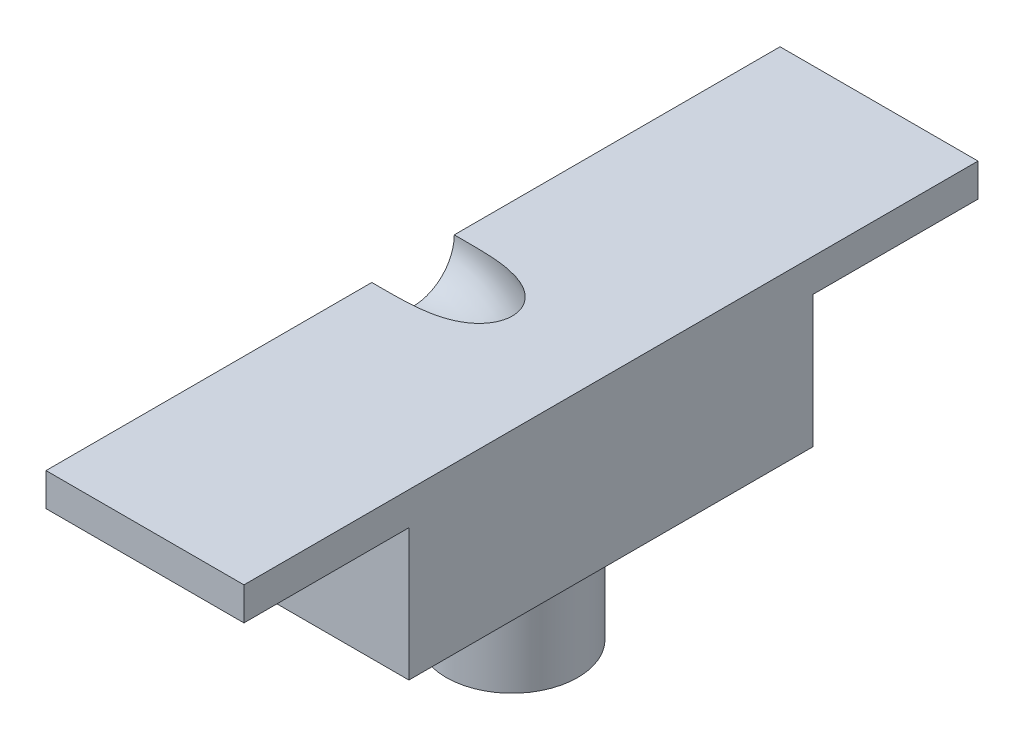
ISO-10303-21;
HEADER;
FILE_DESCRIPTION(('STEP AP214'),'2;1');
FILE_NAME('part.step','',(''),(''),'','','');
FILE_SCHEMA(('AUTOMOTIVE_DESIGN { 1 0 10303 214 1 1 1 1 }'));
ENDSEC;
DATA;
#1=APPLICATION_CONTEXT('core data for automotive mechanical design processes');
#2=APPLICATION_PROTOCOL_DEFINITION('international standard','automotive_design',2000,#1);
#3=PRODUCT_CONTEXT('',#1,'mechanical');
#4=PRODUCT('Part','Part','',(#3));
#5=PRODUCT_RELATED_PRODUCT_CATEGORY('part','',(#4));
#6=PRODUCT_DEFINITION_FORMATION('','',#4);
#7=PRODUCT_DEFINITION_CONTEXT('part definition',#1,'design');
#8=PRODUCT_DEFINITION('design','',#6,#7);
#9=PRODUCT_DEFINITION_SHAPE('','',#8);
#10=(LENGTH_UNIT() NAMED_UNIT(*) SI_UNIT(.MILLI.,.METRE.));
#11=(NAMED_UNIT(*) PLANE_ANGLE_UNIT() SI_UNIT($,.RADIAN.));
#12=(NAMED_UNIT(*) SI_UNIT($,.STERADIAN.) SOLID_ANGLE_UNIT());
#13=UNCERTAINTY_MEASURE_WITH_UNIT(LENGTH_MEASURE(1.E-05),#10,'distance_accuracy_value','');
#14=(GEOMETRIC_REPRESENTATION_CONTEXT(3) GLOBAL_UNCERTAINTY_ASSIGNED_CONTEXT((#13)) GLOBAL_UNIT_ASSIGNED_CONTEXT((#10,
#11,#12)) REPRESENTATION_CONTEXT('',''));
#15=CARTESIAN_POINT('',(0.,0.,0.));
#16=DIRECTION('',(0.,0.,1.));
#17=DIRECTION('',(1.,0.,0.));
#18=AXIS2_PLACEMENT_3D('',#15,#16,#17);
#19=CARTESIAN_POINT('',(-6.,17.,12.25));
#20=DIRECTION('',(0.,0.,-1.));
#21=DIRECTION('',(-1.,0.,0.));
#22=AXIS2_PLACEMENT_3D('',#19,#20,#21);
#23=PLANE('',#22);
#24=DIRECTION('',(1.,0.,0.));
#25=VECTOR('',#24,1.);
#26=CARTESIAN_POINT('',(-16.1980390271856,15.,12.25));
#27=LINE('',#26,#25);
#28=CARTESIAN_POINT('',(-6.,15.,12.25));
#29=VERTEX_POINT('',#28);
#30=CARTESIAN_POINT('',(6.,15.,12.25));
#31=VERTEX_POINT('',#30);
#32=EDGE_CURVE('E66',#29,#31,#27,.T.);
#33=ORIENTED_EDGE('',*,*,#32,.F.);
#34=DIRECTION('',(0.,-1.,0.));
#35=VECTOR('',#34,1.);
#36=CARTESIAN_POINT('',(-6.,17.,12.25));
#37=LINE('',#36,#35);
#38=CARTESIAN_POINT('',(-6.,7.,12.25));
#39=VERTEX_POINT('',#38);
#40=EDGE_CURVE('E256',#29,#39,#37,.T.);
#41=ORIENTED_EDGE('',*,*,#40,.T.);
#42=DIRECTION('',(1.,0.,0.));
#43=VECTOR('',#42,1.);
#44=CARTESIAN_POINT('',(-6.,7.,12.25));
#45=LINE('',#44,#43);
#46=CARTESIAN_POINT('',(6.,7.,12.25));
#47=VERTEX_POINT('',#46);
#48=EDGE_CURVE('E243',#39,#47,#45,.T.);
#49=ORIENTED_EDGE('',*,*,#48,.T.);
#50=DIRECTION('',(0.,-1.,0.));
#51=VECTOR('',#50,1.);
#52=CARTESIAN_POINT('',(6.,17.,12.25));
#53=LINE('',#52,#51);
#54=EDGE_CURVE('E254',#31,#47,#53,.T.);
#55=ORIENTED_EDGE('',*,*,#54,.F.);
#56=EDGE_LOOP('',(#33,#41,#49,#55));
#57=FACE_BOUND('',#56,.T.);
#58=ADVANCED_FACE('F37',(#57),#23,.F.);
#59=CARTESIAN_POINT('',(-6.,17.,-12.25));
#60=DIRECTION('',(1.,0.,0.));
#61=DIRECTION('',(0.,0.,-1.));
#62=AXIS2_PLACEMENT_3D('',#59,#60,#61);
#63=PLANE('',#62);
#64=CARTESIAN_POINT('',(-5.99999999662112,16.9911062608069,-2.5));
#65=CARTESIAN_POINT('',(-5.99999999548499,17.0612754814872,-2.49999917679118));
#66=CARTESIAN_POINT('',(-5.99999999878975,17.1314648255298,-2.49704278144887));
#67=CARTESIAN_POINT('',(-6.00000000121075,17.2713632531672,-2.48523473279341));
#68=CARTESIAN_POINT('',(-6.00000000032525,17.3410721256429,-2.47638063649341));
#69=CARTESIAN_POINT('',(-5.9999999996741,17.4796447102253,-2.45281166015836));
#70=CARTESIAN_POINT('',(-5.99999999991072,17.5485064272413,-2.43808495975812));
#71=CARTESIAN_POINT('',(-6.00000000008935,17.6847798912383,-2.40287278981151));
#72=CARTESIAN_POINT('',(-6.00000000003112,17.752190462718,-2.38238282770307));
#73=CARTESIAN_POINT('',(-5.99999999993793,17.9512084057132,-2.31256133726961));
#74=CARTESIAN_POINT('',(-5.99999999998374,18.0799684802196,-2.25481546024213));
#75=CARTESIAN_POINT('',(-6.00000000001626,18.3259528146609,-2.11849508044642));
#76=CARTESIAN_POINT('',(-6.00000000000298,18.443176550403,-2.03991963181432));
#77=CARTESIAN_POINT('',(-5.99999999999851,18.6078105782702,-1.90822461927894));
#78=CARTESIAN_POINT('',(-5.9999999999996,18.6608519972462,-1.86198696101606));
#79=CARTESIAN_POINT('',(-6.0000000000004,18.7628145374143,-1.76524422547874));
#80=CARTESIAN_POINT('',(-6.00000000000011,18.8117395860872,-1.71474331017464));
#81=CARTESIAN_POINT('',(-5.99999999999989,18.9051843007496,-1.60977361664169));
#82=CARTESIAN_POINT('',(-5.99999999999997,18.9497018214781,-1.55530292839372));
#83=CARTESIAN_POINT('',(-6.00000000000003,19.0339941940812,-1.44280976211572));
#84=CARTESIAN_POINT('',(-6.00000000000001,19.0737679441262,-1.38478646364321));
#85=CARTESIAN_POINT('',(-5.99999999999998,19.1855009029571,-1.20602374612361));
#86=CARTESIAN_POINT('',(-5.99999999999999,19.2499730658632,-1.08047756158767));
#87=CARTESIAN_POINT('',(-6.00000000000001,19.3568849024175,-0.820411560107901));
#88=CARTESIAN_POINT('',(-6.,19.39932495243,-0.685891896498042));
#89=CARTESIAN_POINT('',(-6.,19.4610294512489,-0.411620891112567));
#90=CARTESIAN_POINT('',(-6.,19.4802940265194,-0.271869577889315));
#91=CARTESIAN_POINT('',(-6.,19.4950815594367,0.00888374290003644));
#92=CARTESIAN_POINT('',(-6.,19.4906044836919,0.149885752224917));
#93=CARTESIAN_POINT('',(-6.,19.4580537816676,0.429119507088818));
#94=CARTESIAN_POINT('',(-6.,19.4299803887296,0.567351280008554));
#95=CARTESIAN_POINT('',(-6.,19.35098213126,0.837204274468014));
#96=CARTESIAN_POINT('',(-6.,19.3000571339859,0.968825457602624));
#97=CARTESIAN_POINT('',(-6.,19.2077259873993,1.1583299987547));
#98=CARTESIAN_POINT('',(-6.,19.1742702584347,1.2202068802919));
#99=CARTESIAN_POINT('',(-6.,19.1022674539404,1.34092578269892));
#100=CARTESIAN_POINT('',(-6.,19.0637215567942,1.39976850161244));
#101=CARTESIAN_POINT('',(-6.,18.9818253144,1.51397139678755));
#102=CARTESIAN_POINT('',(-6.,18.9384770129003,1.56933303887901));
#103=CARTESIAN_POINT('',(-6.,18.8472433759708,1.67625270987987));
#104=CARTESIAN_POINT('',(-6.,18.7993537108727,1.72780702395053));
#105=CARTESIAN_POINT('',(-6.,18.6494717250249,1.87606618088082));
#106=CARTESIAN_POINT('',(-6.,18.5411570244777,1.96651946601354));
#107=CARTESIAN_POINT('',(-6.,18.310864941686,2.12792603606321));
#108=CARTESIAN_POINT('',(-6.,18.1888879249075,2.19887984241456));
#109=CARTESIAN_POINT('',(-6.,17.9983413386896,2.28921057991852));
#110=CARTESIAN_POINT('',(-6.,17.9334885954531,2.3166582827175));
#111=CARTESIAN_POINT('',(-6.,17.801740105853,2.36597406775493));
#112=CARTESIAN_POINT('',(-6.,17.7348461514001,2.38784689468328));
#113=CARTESIAN_POINT('',(-6.,17.5995323641709,2.42585377885879));
#114=CARTESIAN_POINT('',(-6.,17.5311143095163,2.44199418590801));
#115=CARTESIAN_POINT('',(-6.,17.3931712246026,2.46845705381251));
#116=CARTESIAN_POINT('',(-6.,17.3236463596585,2.4787803752869));
#117=CARTESIAN_POINT('',(-6.,17.1849138514212,2.49343939105746));
#118=CARTESIAN_POINT('',(-6.,17.115714495176,2.49785366480318));
#119=CARTESIAN_POINT('',(-6.,16.9771882164399,2.50092099991182));
#120=CARTESIAN_POINT('',(-6.,16.9078612939518,2.49957406140349));
#121=CARTESIAN_POINT('',(-6.,16.7686148621845,2.4910701624752));
#122=CARTESIAN_POINT('',(-6.,16.6987001589193,2.48383424552796));
#123=CARTESIAN_POINT('',(-6.,16.5597188895675,2.46350277056509));
#124=CARTESIAN_POINT('',(-6.,16.4906524505504,2.45040634538719));
#125=CARTESIAN_POINT('',(-6.,16.3537869693681,2.41842553953638));
#126=CARTESIAN_POINT('',(-6.,16.2859894227403,2.39953473565595));
#127=CARTESIAN_POINT('',(-6.,16.1521852341975,2.35609808906815));
#128=CARTESIAN_POINT('',(-6.,16.0861801725279,2.3315474267038));
#129=CARTESIAN_POINT('',(-6.,15.891815875474,2.24973654924145));
#130=CARTESIAN_POINT('',(-6.,15.7668128733292,2.18424826689066));
#131=CARTESIAN_POINT('',(-6.,15.5295932760164,2.03318590316982));
#132=CARTESIAN_POINT('',(-6.,15.4173770235171,1.94761128369938));
#133=CARTESIAN_POINT('',(-6.,15.261074321427,1.80612426724228));
#134=CARTESIAN_POINT('',(-6.,15.2109479532827,1.75673750827536));
#135=CARTESIAN_POINT('',(-6.,15.1150681443904,1.65395522776921));
#136=CARTESIAN_POINT('',(-6.,15.0693105420613,1.60056360952937));
#137=CARTESIAN_POINT('',(-6.,14.9824373937259,1.49009147512444));
#138=CARTESIAN_POINT('',(-6.,14.941323824644,1.43300940410208));
#139=CARTESIAN_POINT('',(-6.,14.8640468820907,1.31558933786349));
#140=CARTESIAN_POINT('',(-6.,14.8278846550366,1.25525059310146));
#141=CARTESIAN_POINT('',(-6.,14.7272567052061,1.07001069770285));
#142=CARTESIAN_POINT('',(-6.,14.6705572121912,0.940768034008188));
#143=CARTESIAN_POINT('',(-6.,14.5796964605777,0.674667218976949));
#144=CARTESIAN_POINT('',(-6.,14.5455350669525,0.537809113270133));
#145=CARTESIAN_POINT('',(-6.,14.500665019495,0.260286212007485));
#146=CARTESIAN_POINT('',(-6.,14.4899557991788,0.119621508482579));
#147=CARTESIAN_POINT('',(-6.,14.4923111099998,-0.161508508379609));
#148=CARTESIAN_POINT('',(-6.,14.505375604113,-0.30197382202707));
#149=CARTESIAN_POINT('',(-6.,14.5548879033267,-0.578699241367726));
#150=CARTESIAN_POINT('',(-6.,14.5913352077604,-0.714959437034378));
#151=CARTESIAN_POINT('',(-6.,14.6866354677337,-0.97949031304884));
#152=CARTESIAN_POINT('',(-6.00000000000001,14.7454888056624,-1.10776085699903));
#153=CARTESIAN_POINT('',(-6.,14.8492003762446,-1.2912846082618));
#154=CARTESIAN_POINT('',(-5.99999999999999,14.8863667900878,-1.35100834794157));
#155=CARTESIAN_POINT('',(-6.00000000000001,14.9655966551264,-1.46711606795183));
#156=CARTESIAN_POINT('',(-6.00000000000004,15.0076589694084,-1.52350081908329));
#157=CARTESIAN_POINT('',(-5.99999999999996,15.096364294603,-1.63249795792673));
#158=CARTESIAN_POINT('',(-5.99999999999984,15.1430050783876,-1.6851121584291));
#159=CARTESIAN_POINT('',(-6.00000000000016,15.2405831469697,-1.78626796361863));
#160=CARTESIAN_POINT('',(-6.0000000000006,15.2915245389584,-1.8348055847889));
#161=CARTESIAN_POINT('',(-5.9999999999988,15.4501650312028,-1.97365345303115));
#162=CARTESIAN_POINT('',(-5.99999999999346,15.5637940417232,-2.05733800743019));
#163=CARTESIAN_POINT('',(-6.00000000000654,15.8034988775456,-2.20440874381926));
#164=CARTESIAN_POINT('',(-6.00000000002498,15.9295741380282,-2.26779584636803));
#165=CARTESIAN_POINT('',(-5.99999999998748,16.1253037659603,-2.34635728850237));
#166=CARTESIAN_POINT('',(-5.99999999996405,16.1917413817409,-2.36981113041721));
#167=CARTESIAN_POINT('',(-6.00000000003593,16.326322814736,-2.41102103232568));
#168=CARTESIAN_POINT('',(-6.00000000013114,16.3944652588285,-2.42878152815142));
#169=CARTESIAN_POINT('',(-5.99999999986912,16.5318589404491,-2.45846146959885));
#170=CARTESIAN_POINT('',(-5.9999999995128,16.6011076616145,-2.47039263563448));
#171=CARTESIAN_POINT('',(-6.000000000487,16.7403464906537,-2.48838188700288));
#172=CARTESIAN_POINT('',(-6.00000000181682,16.810336279464,-2.49444240365856));
#173=CARTESIAN_POINT('',(-5.99999999904449,16.9173043446433,-2.4991833634724));
#174=CARTESIAN_POINT('',(-5.99999999721864,16.9542025196941,-2.50000043294602));
#175=CARTESIAN_POINT('',(-5.99999999662112,16.9911062608069,-2.5));
#176=B_SPLINE_CURVE_WITH_KNOTS('',3,(#64,#65,#66,#67,#68,#69,#70,#71,#72,#73,#74,#75,#76,#77,
#78,#79,#80,#81,#82,#83,#84,#85,#86,#87,#88,#89,#90,#91,#92,#93,#94,#95,#96,#97,#98,#99,#100,
#101,#102,#103,#104,#105,#106,#107,#108,#109,#110,#111,#112,#113,#114,#115,#116,#117,#118,#119,
#120,#121,#122,#123,#124,#125,#126,#127,#128,#129,#130,#131,#132,#133,#134,#135,#136,#137,#138,
#139,#140,#141,#142,#143,#144,#145,#146,#147,#148,#149,#150,#151,#152,#153,#154,#155,#156,#157,
#158,#159,#160,#161,#162,#163,#164,#165,#166,#167,#168,#169,#170,#171,#172,#173,#174,#175),
.UNSPECIFIED.,.T.,.F.,(4,2,2,2,2,2,2,2,2,2,2,2,2,2,2,2,2,2,2,2,2,2,2,2,2,2,2,2,2,2,2,2,2,2,2,2,
2,2,2,2,2,2,2,2,2,2,2,2,2,2,2,2,2,2,2,4),(0.,0.210479846317896,0.421046933330952,
0.632040006068487,0.84319800955464,1.26441282210354,1.68564676515317,1.89653372219488,
2.10721713201651,2.31800258806673,2.52883690803406,2.95005403726525,3.37126397080816,
3.79247160588165,4.21367983336912,4.63488389562474,5.05609040463916,5.2669115412899,
5.47768395773118,5.68836701831692,5.8992530000182,6.32046976903219,6.74167527321727,
6.95273164131906,7.16360777826945,7.37424959376991,7.58486023730335,7.79264136262042,
8.00042248329414,8.21103624219388,8.421681175306,8.63256046246107,8.84361999171499,
9.26484263021229,9.68607655428826,9.89697183796575,10.1076641805053,10.3184458775939,
10.529276296144,10.9504933463207,11.3717078729455,11.7929122250803,12.2141159212508,
12.6353105990146,13.0565124653538,13.267338560284,13.4781157950325,13.6887910036798,
13.8996697393198,14.3208948454103,14.7421008447977,14.9532591853179,15.1642526048195,
15.3748200384167,15.5853002284139,15.6959968227706),.UNSPECIFIED.);
#177=CARTESIAN_POINT('',(-6.,17.,2.49998418083522));
#178=VERTEX_POINT('',#177);
#179=CARTESIAN_POINT('',(-6.00000000000001,17.,-2.49998418083522));
#180=VERTEX_POINT('',#179);
#181=EDGE_CURVE('E161',#178,#180,#176,.T.);
#182=ORIENTED_EDGE('',*,*,#181,.T.);
#183=DIRECTION('',(0.,0.,1.));
#184=VECTOR('',#183,1.);
#185=CARTESIAN_POINT('',(-6.,17.,-12.25));
#186=LINE('',#185,#184);
#187=CARTESIAN_POINT('',(-6.,17.,-22.25));
#188=VERTEX_POINT('',#187);
#189=EDGE_CURVE('E249',#188,#180,#186,.T.);
#190=ORIENTED_EDGE('',*,*,#189,.F.);
#191=DIRECTION('',(0.,-1.,0.));
#192=VECTOR('',#191,1.);
#193=CARTESIAN_POINT('',(-6.,17.,-22.25));
#194=LINE('',#193,#192);
#195=CARTESIAN_POINT('',(-6.,15.,-22.25));
#196=VERTEX_POINT('',#195);
#197=EDGE_CURVE('E136',#188,#196,#194,.T.);
#198=ORIENTED_EDGE('',*,*,#197,.T.);
#199=DIRECTION('',(0.,0.,1.));
#200=VECTOR('',#199,1.);
#201=CARTESIAN_POINT('',(-6.,15.,-12.25));
#202=LINE('',#201,#200);
#203=CARTESIAN_POINT('',(-6.,15.,-12.25));
#204=VERTEX_POINT('',#203);
#205=EDGE_CURVE('E117',#196,#204,#202,.T.);
#206=ORIENTED_EDGE('',*,*,#205,.T.);
#207=DIRECTION('',(0.,-1.,0.));
#208=VECTOR('',#207,1.);
#209=CARTESIAN_POINT('',(-6.,17.,-12.25));
#210=LINE('',#209,#208);
#211=CARTESIAN_POINT('',(-6.,7.,-12.25));
#212=VERTEX_POINT('',#211);
#213=EDGE_CURVE('E228',#204,#212,#210,.T.);
#214=ORIENTED_EDGE('',*,*,#213,.T.);
#215=DIRECTION('',(0.,0.,1.));
#216=VECTOR('',#215,1.);
#217=CARTESIAN_POINT('',(-6.,7.,-12.25));
#218=LINE('',#217,#216);
#219=EDGE_CURVE('E247',#212,#39,#218,.T.);
#220=ORIENTED_EDGE('',*,*,#219,.T.);
#221=ORIENTED_EDGE('',*,*,#40,.F.);
#222=DIRECTION('',(0.,0.,1.));
#223=VECTOR('',#222,1.);
#224=CARTESIAN_POINT('',(-6.,15.,12.25));
#225=LINE('',#224,#223);
#226=CARTESIAN_POINT('',(-6.,15.,22.25));
#227=VERTEX_POINT('',#226);
#228=EDGE_CURVE('E145',#29,#227,#225,.T.);
#229=ORIENTED_EDGE('',*,*,#228,.T.);
#230=DIRECTION('',(0.,1.,0.));
#231=VECTOR('',#230,1.);
#232=CARTESIAN_POINT('',(-6.,17.,22.25));
#233=LINE('',#232,#231);
#234=CARTESIAN_POINT('',(-6.,17.,22.25));
#235=VERTEX_POINT('',#234);
#236=EDGE_CURVE('E142',#227,#235,#233,.T.);
#237=ORIENTED_EDGE('',*,*,#236,.T.);
#238=EDGE_CURVE('E261',#178,#235,#186,.T.);
#239=ORIENTED_EDGE('',*,*,#238,.F.);
#240=EDGE_LOOP('',(#182,#190,#198,#206,#214,#220,#221,#229,#237,#239));
#241=FACE_BOUND('',#240,.T.);
#242=ADVANCED_FACE('F191',(#241),#63,.F.);
#243=CARTESIAN_POINT('',(0.,17.,0.));
#244=DIRECTION('',(0.,1.,0.));
#245=DIRECTION('',(0.,0.,1.));
#246=AXIS2_PLACEMENT_3D('',#243,#244,#245);
#247=PLANE('',#246);
#248=ORIENTED_EDGE('',*,*,#189,.T.);
#249=CARTESIAN_POINT('',(-6.,17.,-2.49998418083522));
#250=CARTESIAN_POINT('',(-5.91835423553556,17.,-2.49997692436198));
#251=CARTESIAN_POINT('',(-5.83670848015727,17.,-2.49997608089899));
#252=CARTESIAN_POINT('',(-5.67341677418639,17.,-2.49994694041733));
#253=CARTESIAN_POINT('',(-5.59177082359382,17.,-2.49991864333062));
#254=CARTESIAN_POINT('',(-5.42824329184735,17.,-2.49979413625982));
#255=CARTESIAN_POINT('',(-5.3463617106823,17.,-2.49969773051771));
#256=CARTESIAN_POINT('',(-5.18259895562537,17.,-2.49934636189439));
#257=CARTESIAN_POINT('',(-5.10071778173356,17.,-2.49909139899149));
#258=CARTESIAN_POINT('',(-4.85487874587565,17.,-2.49786733038095));
#259=CARTESIAN_POINT('',(-4.69092199115899,17.,-2.49643855586157));
#260=CARTESIAN_POINT('',(-4.36026129723892,17.,-2.49078729844717));
#261=CARTESIAN_POINT('',(-4.19355798085057,17.,-2.48651779234287));
#262=CARTESIAN_POINT('',(-3.86049933960332,17.,-2.47315275884974));
#263=CARTESIAN_POINT('',(-3.6941438331631,17.,-2.46406221297105));
#264=CARTESIAN_POINT('',(-3.362057328201,17.,-2.4387006873986));
#265=CARTESIAN_POINT('',(-3.19632595464101,17.,-2.42243510259839));
#266=CARTESIAN_POINT('',(-2.92888518641855,17.,-2.38811005879989));
#267=CARTESIAN_POINT('',(-2.82679006278956,17.,-2.37308353883606));
#268=CARTESIAN_POINT('',(-2.62333696849753,17.,-2.33853875044068));
#269=CARTESIAN_POINT('',(-2.52197911466677,17.,-2.31901978544442));
#270=CARTESIAN_POINT('',(-2.32047466375129,17.,-2.27476302712651));
#271=CARTESIAN_POINT('',(-2.22032707765619,17.,-2.25002984960771));
#272=CARTESIAN_POINT('',(-2.02173890623564,17.,-2.19458821818799));
#273=CARTESIAN_POINT('',(-1.92329823071782,17.,-2.16388008105556));
#274=CARTESIAN_POINT('',(-1.62829044511553,17.,-2.06043529442461));
#275=CARTESIAN_POINT('',(-1.43512517209203,17.,-1.97699491506601));
#276=CARTESIAN_POINT('',(-1.15961326903405,17.,-1.82648289463074));
#277=CARTESIAN_POINT('',(-1.07022725439938,17.,-1.77215094737631));
#278=CARTESIAN_POINT('',(-0.897637589032755,17.,-1.65447745599829));
#279=CARTESIAN_POINT('',(-0.814428496127563,17.,-1.59114398958742));
#280=CARTESIAN_POINT('',(-0.642178779675944,17.,-1.44324216591484));
#281=CARTESIAN_POINT('',(-0.554643209052686,17.,-1.35689643913744));
#282=CARTESIAN_POINT('',(-0.394154344540844,17.,-1.17136228267834));
#283=CARTESIAN_POINT('',(-0.321197637184144,17.,-1.07217686824038));
#284=CARTESIAN_POINT('',(-0.225457508987284,17.,-0.914486137458237));
#285=CARTESIAN_POINT('',(-0.195710100582197,17.,-0.860135527536049));
#286=CARTESIAN_POINT('',(-0.141451432181994,17.,-0.748893773826711));
#287=CARTESIAN_POINT('',(-0.116937405372343,17.,-0.692003991795548));
#288=CARTESIAN_POINT('',(-0.0736068938902154,17.,-0.576118824069872));
#289=CARTESIAN_POINT('',(-0.0547874664019893,17.,-0.517124543605164));
#290=CARTESIAN_POINT('',(-0.0232050114247722,17.,-0.397559307032677));
#291=CARTESIAN_POINT('',(-0.0104410001333279,17.,-0.33698860872796));
#292=CARTESIAN_POINT('',(0.0158187886107142,17.,-0.169712836260683));
#293=CARTESIAN_POINT('',(0.0229137092682861,17.,-0.061923925873127));
#294=CARTESIAN_POINT('',(0.0173853131005899,17.,0.153061011598504));
#295=CARTESIAN_POINT('',(0.00476848993418454,17.,0.260257222262687));
#296=CARTESIAN_POINT('',(-0.0377312643913309,17.,0.463277244562081));
#297=CARTESIAN_POINT('',(-0.0663423038643865,17.,0.559371586742345));
#298=CARTESIAN_POINT('',(-0.138288751713891,17.,0.745831879119272));
#299=CARTESIAN_POINT('',(-0.181625456253551,17.,0.836197324223357));
#300=CARTESIAN_POINT('',(-0.284400321674695,17.,1.01548777365125));
#301=CARTESIAN_POINT('',(-0.344733275367596,17.,1.10389659781258));
#302=CARTESIAN_POINT('',(-0.477279091136978,17.,1.27126639362263));
#303=CARTESIAN_POINT('',(-0.549499946682607,17.,1.35022094605148));
#304=CARTESIAN_POINT('',(-0.743562048456688,17.,1.53700248552707));
#305=CARTESIAN_POINT('',(-0.871622318605249,17.,1.63837915369197));
#306=CARTESIAN_POINT('',(-1.14218998771042,17.,1.81926533925316));
#307=CARTESIAN_POINT('',(-1.28471623356998,17.,1.89874581564606));
#308=CARTESIAN_POINT('',(-1.54719565921985,17.,2.02320098785902));
#309=CARTESIAN_POINT('',(-1.66542078687614,17.,2.07192037918565));
#310=CARTESIAN_POINT('',(-1.90573366438669,17.,2.15881813402035));
#311=CARTESIAN_POINT('',(-2.02782399885548,17.,2.19698927070997));
#312=CARTESIAN_POINT('',(-2.27542294258797,17.,2.26450740769877));
#313=CARTESIAN_POINT('',(-2.40095108224658,17.,2.29378138497641));
#314=CARTESIAN_POINT('',(-2.65348431897644,17.,2.34457721747707));
#315=CARTESIAN_POINT('',(-2.78048885343451,17.,2.36610193182712));
#316=CARTESIAN_POINT('',(-3.08139865695579,17.,2.40945921869515));
#317=CARTESIAN_POINT('',(-3.25568477187266,17.,2.42859815889744));
#318=CARTESIAN_POINT('',(-3.60508118054646,17.,2.45838259633227));
#319=CARTESIAN_POINT('',(-3.78019208728388,17.,2.46902022519656));
#320=CARTESIAN_POINT('',(-4.13086679346596,17.,2.48460822618254));
#321=CARTESIAN_POINT('',(-4.30643088571615,17.,2.48955129527769));
#322=CARTESIAN_POINT('',(-4.65102806772219,17.,2.49598999479933));
#323=CARTESIAN_POINT('',(-4.8200593976024,17.,2.49760785343211));
#324=CARTESIAN_POINT('',(-5.07348318968761,17.,2.49898912599213));
#325=CARTESIAN_POINT('',(-5.15787419726174,17.,2.49927547322104));
#326=CARTESIAN_POINT('',(-5.3266567178698,17.,2.49966893640313));
#327=CARTESIAN_POINT('',(-5.41104823090375,17.,2.49977605234528));
#328=CARTESIAN_POINT('',(-5.57953324950164,17.,2.49991365642044));
#329=CARTESIAN_POINT('',(-5.66362675507655,17.,2.49994441380683));
#330=CARTESIAN_POINT('',(-5.83181350379894,17.,2.49997563217983));
#331=CARTESIAN_POINT('',(-5.91590674694639,17.,2.49997609326399));
#332=CARTESIAN_POINT('',(-6.00000000000001,17.,2.49998418083522));
#333=B_SPLINE_CURVE_WITH_KNOTS('',3,(#249,#250,#251,#252,#253,#254,#255,#256,#257,#258,#259,
#260,#261,#262,#263,#264,#265,#266,#267,#268,#269,#270,#271,#272,#273,#274,#275,#276,#277,#278,
#279,#280,#281,#282,#283,#284,#285,#286,#287,#288,#289,#290,#291,#292,#293,#294,#295,#296,#297,
#298,#299,#300,#301,#302,#303,#304,#305,#306,#307,#308,#309,#310,#311,#312,#313,#314,#315,#316,
#317,#318,#319,#320,#321,#322,#323,#324,#325,#326,#327,#328,#329,#330,#331,#332),.UNSPECIFIED.,
.F.,.F.,(4,2,2,2,2,2,2,2,2,2,2,2,2,2,2,2,2,2,2,2,2,2,2,2,2,2,2,2,2,2,2,2,2,2,2,2,2,2,2,2,2,4),
(0.,0.244937272691824,0.48987515249649,0.735519912472074,0.981164706045561,1.4730441525851,
1.97327535124637,2.47299067249848,2.97233089782264,3.28183309033684,3.59138330429982,
3.90066063568821,4.20992157489287,4.83782866194903,5.15118406155425,5.46426001963568,
5.83181797329795,6.19928976652407,6.38493685193639,6.57048554396809,6.75593818502229,
6.94136068590259,7.26351290070016,7.58555901095714,7.88503749999956,8.18454235617673,
8.50442183835688,8.8245172939589,9.31174964953621,9.79962514578413,10.1826958666337,
10.5660283897994,10.9524270440585,11.3386829882571,11.8643683724775,12.3905397418741,
12.9173851547245,13.4244909108118,13.67766545709,13.9308400189289,14.1831205676129,
14.4354003039388),.UNSPECIFIED.);
#334=EDGE_CURVE('E11',#180,#178,#333,.T.);
#335=ORIENTED_EDGE('',*,*,#334,.T.);
#336=ORIENTED_EDGE('',*,*,#238,.T.);
#337=DIRECTION('',(1.,0.,0.));
#338=VECTOR('',#337,1.);
#339=CARTESIAN_POINT('',(-16.1980390271856,17.,22.25));
#340=LINE('',#339,#338);
#341=CARTESIAN_POINT('',(6.,17.,22.25));
#342=VERTEX_POINT('',#341);
#343=EDGE_CURVE('E153',#235,#342,#340,.T.);
#344=ORIENTED_EDGE('',*,*,#343,.T.);
#345=DIRECTION('',(0.,0.,-1.));
#346=VECTOR('',#345,1.);
#347=CARTESIAN_POINT('',(6.,17.,-12.25));
#348=LINE('',#347,#346);
#349=CARTESIAN_POINT('',(6.,17.,-22.25));
#350=VERTEX_POINT('',#349);
#351=EDGE_CURVE('E169',#342,#350,#348,.T.);
#352=ORIENTED_EDGE('',*,*,#351,.T.);
#353=DIRECTION('',(1.,0.,0.));
#354=VECTOR('',#353,1.);
#355=CARTESIAN_POINT('',(-16.1980390271856,17.,-22.25));
#356=LINE('',#355,#354);
#357=EDGE_CURVE('E120',#188,#350,#356,.T.);
#358=ORIENTED_EDGE('',*,*,#357,.F.);
#359=EDGE_LOOP('',(#248,#335,#336,#344,#352,#358));
#360=FACE_BOUND('',#359,.T.);
#361=ADVANCED_FACE('F196',(#360),#247,.T.);
#362=CARTESIAN_POINT('',(0.,0.,0.));
#363=DIRECTION('',(0.,1.,0.));
#364=DIRECTION('',(0.,0.,1.));
#365=AXIS2_PLACEMENT_3D('',#362,#363,#364);
#366=PLANE('',#365);
#367=CARTESIAN_POINT('',(0.,0.,0.));
#368=DIRECTION('',(0.,1.,0.));
#369=DIRECTION('',(0.,0.,1.));
#370=AXIS2_PLACEMENT_3D('',#367,#368,#369);
#371=CIRCLE('',#370,3.9875);
#372=CARTESIAN_POINT('',(0.,0.,3.9875));
#373=VERTEX_POINT('',#372);
#374=EDGE_CURVE('E223',#373,#373,#371,.T.);
#375=ORIENTED_EDGE('',*,*,#374,.F.);
#376=EDGE_LOOP('',(#375));
#377=FACE_BOUND('',#376,.T.);
#378=CARTESIAN_POINT('',(0.,0.,0.));
#379=DIRECTION('',(0.,1.,0.));
#380=DIRECTION('',(0.,0.,1.));
#381=AXIS2_PLACEMENT_3D('',#378,#379,#380);
#382=CIRCLE('',#381,2.5);
#383=CARTESIAN_POINT('',(0.,0.,2.5));
#384=VERTEX_POINT('',#383);
#385=EDGE_CURVE('E226',#384,#384,#382,.T.);
#386=ORIENTED_EDGE('',*,*,#385,.T.);
#387=EDGE_LOOP('',(#386));
#388=FACE_BOUND('',#387,.T.);
#389=ADVANCED_FACE('F211',(#377,#388),#366,.F.);
#390=CARTESIAN_POINT('',(0.,7.,0.));
#391=DIRECTION('',(0.,-1.,0.));
#392=DIRECTION('',(0.,0.,-1.));
#393=AXIS2_PLACEMENT_3D('',#390,#391,#392);
#394=CYLINDRICAL_SURFACE('',#393,3.9875);
#395=CARTESIAN_POINT('',(0.,7.,0.));
#396=DIRECTION('',(0.,1.,0.));
#397=DIRECTION('',(0.,0.,1.));
#398=AXIS2_PLACEMENT_3D('',#395,#396,#397);
#399=CIRCLE('',#398,3.9875);
#400=CARTESIAN_POINT('',(0.,7.,3.9875));
#401=VERTEX_POINT('',#400);
#402=EDGE_CURVE('E51',#401,#401,#399,.T.);
#403=ORIENTED_EDGE('',*,*,#402,.F.);
#404=EDGE_LOOP('',(#403));
#405=FACE_BOUND('',#404,.T.);
#406=ORIENTED_EDGE('',*,*,#374,.T.);
#407=EDGE_LOOP('',(#406));
#408=FACE_BOUND('',#407,.T.);
#409=ADVANCED_FACE('F39',(#405,#408),#394,.T.);
#410=CARTESIAN_POINT('',(0.,7.,0.));
#411=DIRECTION('',(0.,-1.,0.));
#412=DIRECTION('',(0.,0.,-1.));
#413=AXIS2_PLACEMENT_3D('',#410,#411,#412);
#414=CYLINDRICAL_SURFACE('',#413,2.5);
#415=ORIENTED_EDGE('',*,*,#385,.F.);
#416=EDGE_LOOP('',(#415));
#417=FACE_BOUND('',#416,.T.);
#418=CARTESIAN_POINT('',(0.,11.,0.));
#419=DIRECTION('',(0.,-1.,0.));
#420=DIRECTION('',(0.,0.,-1.));
#421=AXIS2_PLACEMENT_3D('',#418,#419,#420);
#422=CIRCLE('',#421,2.5);
#423=CARTESIAN_POINT('',(0.,11.,-2.5));
#424=VERTEX_POINT('',#423);
#425=EDGE_CURVE('E147',#424,#424,#422,.T.);
#426=ORIENTED_EDGE('',*,*,#425,.F.);
#427=EDGE_LOOP('',(#426));
#428=FACE_BOUND('',#427,.T.);
#429=ADVANCED_FACE('F208',(#417,#428),#414,.F.);
#430=CARTESIAN_POINT('',(6.,17.,-12.25));
#431=DIRECTION('',(-1.,0.,0.));
#432=DIRECTION('',(0.,0.,1.));
#433=AXIS2_PLACEMENT_3D('',#430,#431,#432);
#434=PLANE('',#433);
#435=DIRECTION('',(0.,0.,-1.));
#436=VECTOR('',#435,1.);
#437=CARTESIAN_POINT('',(6.,7.,-12.25));
#438=LINE('',#437,#436);
#439=CARTESIAN_POINT('',(6.,7.,-12.25));
#440=VERTEX_POINT('',#439);
#441=EDGE_CURVE('E168',#47,#440,#438,.T.);
#442=ORIENTED_EDGE('',*,*,#441,.T.);
#443=DIRECTION('',(0.,-1.,0.));
#444=VECTOR('',#443,1.);
#445=CARTESIAN_POINT('',(6.,17.,-12.25));
#446=LINE('',#445,#444);
#447=CARTESIAN_POINT('',(6.,15.,-12.25));
#448=VERTEX_POINT('',#447);
#449=EDGE_CURVE('E133',#448,#440,#446,.T.);
#450=ORIENTED_EDGE('',*,*,#449,.F.);
#451=DIRECTION('',(0.,0.,-1.));
#452=VECTOR('',#451,1.);
#453=CARTESIAN_POINT('',(6.,15.,-12.25));
#454=LINE('',#453,#452);
#455=CARTESIAN_POINT('',(6.,15.,-22.25));
#456=VERTEX_POINT('',#455);
#457=EDGE_CURVE('E58',#448,#456,#454,.T.);
#458=ORIENTED_EDGE('',*,*,#457,.T.);
#459=DIRECTION('',(0.,1.,0.));
#460=VECTOR('',#459,1.);
#461=CARTESIAN_POINT('',(6.,17.,-22.25));
#462=LINE('',#461,#460);
#463=EDGE_CURVE('E125',#456,#350,#462,.T.);
#464=ORIENTED_EDGE('',*,*,#463,.T.);
#465=ORIENTED_EDGE('',*,*,#351,.F.);
#466=DIRECTION('',(0.,-1.,0.));
#467=VECTOR('',#466,1.);
#468=CARTESIAN_POINT('',(6.,17.,22.25));
#469=LINE('',#468,#467);
#470=CARTESIAN_POINT('',(6.,15.,22.25));
#471=VERTEX_POINT('',#470);
#472=EDGE_CURVE('E141',#342,#471,#469,.T.);
#473=ORIENTED_EDGE('',*,*,#472,.T.);
#474=DIRECTION('',(0.,0.,-1.));
#475=VECTOR('',#474,1.);
#476=CARTESIAN_POINT('',(6.,15.,12.25));
#477=LINE('',#476,#475);
#478=EDGE_CURVE('E150',#471,#31,#477,.T.);
#479=ORIENTED_EDGE('',*,*,#478,.T.);
#480=ORIENTED_EDGE('',*,*,#54,.T.);
#481=EDGE_LOOP('',(#442,#450,#458,#464,#465,#473,#479,#480));
#482=FACE_BOUND('',#481,.T.);
#483=ADVANCED_FACE('F132',(#482),#434,.F.);
#484=CARTESIAN_POINT('',(-6.,17.,-12.25));
#485=DIRECTION('',(0.,0.,1.));
#486=DIRECTION('',(1.,0.,0.));
#487=AXIS2_PLACEMENT_3D('',#484,#485,#486);
#488=PLANE('',#487);
#489=ORIENTED_EDGE('',*,*,#213,.F.);
#490=DIRECTION('',(1.,0.,0.));
#491=VECTOR('',#490,1.);
#492=CARTESIAN_POINT('',(-16.1980390271856,15.,-12.25));
#493=LINE('',#492,#491);
#494=EDGE_CURVE('E121',#204,#448,#493,.T.);
#495=ORIENTED_EDGE('',*,*,#494,.T.);
#496=ORIENTED_EDGE('',*,*,#449,.T.);
#497=DIRECTION('',(-1.,0.,0.));
#498=VECTOR('',#497,1.);
#499=CARTESIAN_POINT('',(-6.,7.,-12.25));
#500=LINE('',#499,#498);
#501=EDGE_CURVE('E245',#440,#212,#500,.T.);
#502=ORIENTED_EDGE('',*,*,#501,.T.);
#503=EDGE_LOOP('',(#489,#495,#496,#502));
#504=FACE_BOUND('',#503,.T.);
#505=ADVANCED_FACE('F202',(#504),#488,.F.);
#506=CARTESIAN_POINT('',(0.,7.,0.));
#507=DIRECTION('',(0.,1.,0.));
#508=DIRECTION('',(0.,0.,1.));
#509=AXIS2_PLACEMENT_3D('',#506,#507,#508);
#510=PLANE('',#509);
#511=ORIENTED_EDGE('',*,*,#402,.T.);
#512=EDGE_LOOP('',(#511));
#513=FACE_BOUND('',#512,.T.);
#514=ORIENTED_EDGE('',*,*,#441,.F.);
#515=ORIENTED_EDGE('',*,*,#48,.F.);
#516=ORIENTED_EDGE('',*,*,#219,.F.);
#517=ORIENTED_EDGE('',*,*,#501,.F.);
#518=EDGE_LOOP('',(#514,#515,#516,#517));
#519=FACE_BOUND('',#518,.T.);
#520=ADVANCED_FACE('F200',(#513,#519),#510,.F.);
#521=CARTESIAN_POINT('',(0.,11.,-2.5));
#522=CARTESIAN_POINT('',(0.,11.0262936706715,-2.5));
#523=CARTESIAN_POINT('',(-0.000180454932896296,11.0526455472834,-2.5));
#524=CARTESIAN_POINT('',(-0.000903918339657075,11.105457980209,-2.5));
#525=CARTESIAN_POINT('',(-0.00144692659570226,11.1319185375474,-2.5));
#526=CARTESIAN_POINT('',(-0.00362224692401369,11.2114516320901,-2.5));
#527=CARTESIAN_POINT('',(-0.00580085377753461,11.2646755954853,-2.5));
#528=CARTESIAN_POINT('',(-0.0145415767473644,11.42486040814,-2.5));
#529=CARTESIAN_POINT('',(-0.0233085937397529,11.5323341870803,-2.5));
#530=CARTESIAN_POINT('',(-0.0585870204562884,11.856065050295,-2.5));
#531=CARTESIAN_POINT('',(-0.094075802940373,12.0736316749787,-2.5));
#532=CARTESIAN_POINT('',(-0.237713791670884,12.7256323020605,-2.5));
#533=CARTESIAN_POINT('',(-0.383034633069363,13.1593678401679,-2.5));
#534=CARTESIAN_POINT('',(-0.977780850535358,14.4102740214851,-2.5));
#535=CARTESIAN_POINT('',(-1.58600995608787,15.1687756766213,-2.5));
#536=CARTESIAN_POINT('',(-2.68582866216639,16.0231238238343,-2.5));
#537=CARTESIAN_POINT('',(-3.08165976263202,16.2600642338471,-2.5));
#538=CARTESIAN_POINT('',(-3.69466213857667,16.5423888529459,-2.5));
#539=CARTESIAN_POINT('',(-3.90220573967225,16.6243161153292,-2.5));
#540=CARTESIAN_POINT('',(-4.3196154950693,16.7635884934044,-2.5));
#541=CARTESIAN_POINT('',(-4.52948243257186,16.8209353714721,-2.5));
#542=CARTESIAN_POINT('',(-4.94743938522109,16.910819675684,-2.5));
#543=CARTESIAN_POINT('',(-5.15453924421206,16.941102383066,-2.5));
#544=CARTESIAN_POINT('',(-5.56419194998416,16.9801539978083,-2.5));
#545=CARTESIAN_POINT('',(-5.76674557393609,16.9889246498264,-2.5));
#546=CARTESIAN_POINT('',(-6.36641056830503,16.9946946641776,-2.5));
#547=CARTESIAN_POINT('',(-6.75552606532489,16.971152044052,-2.5));
#548=CARTESIAN_POINT('',(-7.13083990769105,16.9514826627312,-2.5));
#549=CARTESIAN_POINT('',(5.,11.,-2.5));
#550=CARTESIAN_POINT('',(5.,11.0377321000175,-2.5));
#551=CARTESIAN_POINT('',(4.99966256701412,11.0983500750205,-2.5));
#552=CARTESIAN_POINT('',(4.99831491558739,11.1967279114206,-2.5));
#553=CARTESIAN_POINT('',(4.99730469605258,11.245926202495,-2.5));
#554=CARTESIAN_POINT('',(4.99326702050088,11.3935499138232,-2.5));
#555=CARTESIAN_POINT('',(4.98923283834965,11.4920043010457,-2.5));
#556=CARTESIAN_POINT('',(4.97310952205931,11.7874844920818,-2.5));
#557=CARTESIAN_POINT('',(4.9570037208956,11.9846296539127,-2.5));
#558=CARTESIAN_POINT('',(4.89250795572595,12.5764720884289,-2.5));
#559=CARTESIAN_POINT('',(4.82799030975358,12.9716221314107,-2.5));
#560=CARTESIAN_POINT('',(4.56688758556713,14.1568179233714,-2.5));
#561=CARTESIAN_POINT('',(4.30445723865467,14.9447763555004,-2.5));
#562=CARTESIAN_POINT('',(3.19402697545485,17.2802984090043,-2.5));
#563=CARTESIAN_POINT('',(2.11740435017895,18.6232652592933,-2.5));
#564=CARTESIAN_POINT('',(0.0634361511915909,20.2188054176192,-2.5));
#565=CARTESIAN_POINT('',(-0.656087350679076,20.647748356097,-2.5));
#566=CARTESIAN_POINT('',(-1.77000578570961,21.1607750755735,-2.5));
#567=CARTESIAN_POINT('',(-2.14683516997444,21.3095989038549,-2.5));
#568=CARTESIAN_POINT('',(-2.90993117379978,21.5642124900608,-2.5));
#569=CARTESIAN_POINT('',(-3.28096184837137,21.6667508577441,-2.5));
#570=CARTESIAN_POINT('',(-4.0933948175824,21.8414667287086,-2.5));
#571=CARTESIAN_POINT('',(-4.51085620515464,21.9024084511032,-2.5));
#572=CARTESIAN_POINT('',(-5.25889146904987,21.973717606406,-2.5));
#573=CARTESIAN_POINT('',(-5.6048952094675,21.9875987667717,-2.5));
#574=CARTESIAN_POINT('',(-6.54578730533096,21.9966521003957,-2.5));
#575=CARTESIAN_POINT('',(-7.04506710936363,21.9628395672497,-2.5));
#576=CARTESIAN_POINT('',(-7.39251968890588,21.944630336504,-2.5));
#577=CARTESIAN_POINT('',(5.,11.,2.5));
#578=CARTESIAN_POINT('',(5.,11.0377321000175,2.5));
#579=CARTESIAN_POINT('',(4.99966256701412,11.0983500750205,2.5));
#580=CARTESIAN_POINT('',(4.99831491558739,11.1967279114206,2.5));
#581=CARTESIAN_POINT('',(4.99730469605258,11.245926202495,2.5));
#582=CARTESIAN_POINT('',(4.99326702050088,11.3935499138232,2.5));
#583=CARTESIAN_POINT('',(4.98923283834965,11.4920043010457,2.5));
#584=CARTESIAN_POINT('',(4.97310952205931,11.7874844920818,2.5));
#585=CARTESIAN_POINT('',(4.9570037208956,11.9846296539127,2.5));
#586=CARTESIAN_POINT('',(4.89250795572595,12.5764720884289,2.5));
#587=CARTESIAN_POINT('',(4.82799030975358,12.9716221314107,2.5));
#588=CARTESIAN_POINT('',(4.56688758556713,14.1568179233714,2.5));
#589=CARTESIAN_POINT('',(4.30445723865467,14.9447763555004,2.5));
#590=CARTESIAN_POINT('',(3.19402697545485,17.2802984090043,2.5));
#591=CARTESIAN_POINT('',(2.11740435017895,18.6232652592933,2.5));
#592=CARTESIAN_POINT('',(0.0634361511915909,20.2188054176192,2.5));
#593=CARTESIAN_POINT('',(-0.656087350679076,20.647748356097,2.5));
#594=CARTESIAN_POINT('',(-1.77000578570961,21.1607750755735,2.5));
#595=CARTESIAN_POINT('',(-2.14683516997444,21.3095989038549,2.5));
#596=CARTESIAN_POINT('',(-2.90993117379978,21.5642124900608,2.5));
#597=CARTESIAN_POINT('',(-3.28096184837137,21.6667508577441,2.5));
#598=CARTESIAN_POINT('',(-4.0933948175824,21.8414667287086,2.5));
#599=CARTESIAN_POINT('',(-4.51085620515464,21.9024084511032,2.5));
#600=CARTESIAN_POINT('',(-5.25889146904987,21.973717606406,2.5));
#601=CARTESIAN_POINT('',(-5.6048952094675,21.9875987667717,2.5));
#602=CARTESIAN_POINT('',(-6.54578730533096,21.9966521003957,2.5));
#603=CARTESIAN_POINT('',(-7.04506710936363,21.9628395672497,2.5));
#604=CARTESIAN_POINT('',(-7.39251968890588,21.944630336504,2.5));
#605=CARTESIAN_POINT('',(0.,11.,2.5));
#606=CARTESIAN_POINT('',(0.,11.0262936706715,2.5));
#607=CARTESIAN_POINT('',(-0.000180454932895985,11.0526455472834,2.5));
#608=CARTESIAN_POINT('',(-0.000903918339656763,11.105457980209,2.5));
#609=CARTESIAN_POINT('',(-0.00144692659570196,11.1319185375474,2.5));
#610=CARTESIAN_POINT('',(-0.00362224692401339,11.2114516320901,2.5));
#611=CARTESIAN_POINT('',(-0.00580085377753428,11.2646755954853,2.5));
#612=CARTESIAN_POINT('',(-0.0145415767473641,11.42486040814,2.5));
#613=CARTESIAN_POINT('',(-0.0233085937397525,11.5323341870803,2.5));
#614=CARTESIAN_POINT('',(-0.0585870204562881,11.856065050295,2.5));
#615=CARTESIAN_POINT('',(-0.0940758029403728,12.0736316749787,2.5));
#616=CARTESIAN_POINT('',(-0.237713791670884,12.7256323020605,2.5));
#617=CARTESIAN_POINT('',(-0.383034633069363,13.1593678401679,2.5));
#618=CARTESIAN_POINT('',(-0.977780850535357,14.4102740214851,2.5));
#619=CARTESIAN_POINT('',(-1.58600995608787,15.1687756766213,2.5));
#620=CARTESIAN_POINT('',(-2.68582866216639,16.0231238238343,2.5));
#621=CARTESIAN_POINT('',(-3.08165976263202,16.2600642338471,2.5));
#622=CARTESIAN_POINT('',(-3.69466213857667,16.5423888529459,2.5));
#623=CARTESIAN_POINT('',(-3.90220573967225,16.6243161153292,2.5));
#624=CARTESIAN_POINT('',(-4.3196154950693,16.7635884934044,2.5));
#625=CARTESIAN_POINT('',(-4.52948243257186,16.8209353714721,2.5));
#626=CARTESIAN_POINT('',(-4.94743938522109,16.910819675684,2.5));
#627=CARTESIAN_POINT('',(-5.15453924421206,16.941102383066,2.5));
#628=CARTESIAN_POINT('',(-5.56419194998416,16.9801539978083,2.5));
#629=CARTESIAN_POINT('',(-5.76674557393609,16.9889246498264,2.5));
#630=CARTESIAN_POINT('',(-6.36641056830503,16.9946946641776,2.5));
#631=CARTESIAN_POINT('',(-6.75552606532489,16.971152044052,2.5));
#632=CARTESIAN_POINT('',(-7.13083990769105,16.9514826627312,2.5));
#633=CARTESIAN_POINT('',(-5.,11.,2.5));
#634=CARTESIAN_POINT('',(-5.,11.0148552413255,2.5));
#635=CARTESIAN_POINT('',(-5.00002347687991,11.0069410195462,2.5));
#636=CARTESIAN_POINT('',(-5.00012275226671,11.0141880489974,2.5));
#637=CARTESIAN_POINT('',(-5.00019854924398,11.0179108725999,2.5));
#638=CARTESIAN_POINT('',(-5.00051151434891,11.0293533503571,2.5));
#639=CARTESIAN_POINT('',(-5.00083454590472,11.037346889925,2.5));
#640=CARTESIAN_POINT('',(-5.00219267555404,11.0622363241982,2.5));
#641=CARTESIAN_POINT('',(-5.00362090837511,11.0800387202479,2.5));
#642=CARTESIAN_POINT('',(-5.00968199663852,11.1356580121611,2.5));
#643=CARTESIAN_POINT('',(-5.01614191563432,11.1756412185467,2.5));
#644=CARTESIAN_POINT('',(-5.0423151689089,11.2944466807496,2.5));
#645=CARTESIAN_POINT('',(-5.07052650479339,11.3739593248354,2.5));
#646=CARTESIAN_POINT('',(-5.14958867652556,11.540249633966,2.5));
#647=CARTESIAN_POINT('',(-5.28942426235469,11.7142860939493,2.5));
#648=CARTESIAN_POINT('',(-5.43509347552437,11.8274422300495,2.5));
#649=CARTESIAN_POINT('',(-5.50723217458496,11.8723801115973,2.5));
#650=CARTESIAN_POINT('',(-5.61931849144373,11.9240026303184,2.5));
#651=CARTESIAN_POINT('',(-5.65757630937006,11.9390333268036,2.5));
#652=CARTESIAN_POINT('',(-5.72929981633882,11.9629644967479,2.5));
#653=CARTESIAN_POINT('',(-5.77800301677235,11.9751198852001,2.5));
#654=CARTESIAN_POINT('',(-5.80148395285978,11.9801726226593,2.5));
#655=CARTESIAN_POINT('',(-5.79822228326947,11.9797963150287,2.5));
#656=CARTESIAN_POINT('',(-5.86949243091846,11.9865903892107,2.5));
#657=CARTESIAN_POINT('',(-5.92859593840468,11.990250532881,2.5));
#658=CARTESIAN_POINT('',(-6.18703383127911,11.9927372279595,2.5));
#659=CARTESIAN_POINT('',(-6.46598502128615,11.9794645208543,2.5));
#660=CARTESIAN_POINT('',(-6.86916012647621,11.9583349889583,2.5));
#661=CARTESIAN_POINT('',(-5.,11.,-2.5));
#662=CARTESIAN_POINT('',(-5.,11.0148552413255,-2.5));
#663=CARTESIAN_POINT('',(-5.00002347687991,11.0069410195462,-2.5));
#664=CARTESIAN_POINT('',(-5.00012275226671,11.0141880489974,-2.5));
#665=CARTESIAN_POINT('',(-5.00019854924398,11.0179108725999,-2.5));
#666=CARTESIAN_POINT('',(-5.00051151434891,11.0293533503571,-2.5));
#667=CARTESIAN_POINT('',(-5.00083454590472,11.037346889925,-2.5));
#668=CARTESIAN_POINT('',(-5.00219267555404,11.0622363241982,-2.5));
#669=CARTESIAN_POINT('',(-5.00362090837511,11.0800387202479,-2.5));
#670=CARTESIAN_POINT('',(-5.00968199663852,11.1356580121611,-2.5));
#671=CARTESIAN_POINT('',(-5.01614191563432,11.1756412185467,-2.5));
#672=CARTESIAN_POINT('',(-5.0423151689089,11.2944466807496,-2.5));
#673=CARTESIAN_POINT('',(-5.07052650479339,11.3739593248354,-2.5));
#674=CARTESIAN_POINT('',(-5.14958867652556,11.540249633966,-2.5));
#675=CARTESIAN_POINT('',(-5.28942426235469,11.7142860939493,-2.5));
#676=CARTESIAN_POINT('',(-5.43509347552437,11.8274422300495,-2.5));
#677=CARTESIAN_POINT('',(-5.50723217458496,11.8723801115973,-2.5));
#678=CARTESIAN_POINT('',(-5.61931849144373,11.9240026303184,-2.5));
#679=CARTESIAN_POINT('',(-5.65757630937006,11.9390333268036,-2.5));
#680=CARTESIAN_POINT('',(-5.72929981633882,11.9629644967479,-2.5));
#681=CARTESIAN_POINT('',(-5.77800301677235,11.9751198852001,-2.5));
#682=CARTESIAN_POINT('',(-5.80148395285978,11.9801726226593,-2.5));
#683=CARTESIAN_POINT('',(-5.79822228326947,11.9797963150287,-2.5));
#684=CARTESIAN_POINT('',(-5.86949243091846,11.9865903892107,-2.5));
#685=CARTESIAN_POINT('',(-5.92859593840468,11.990250532881,-2.5));
#686=CARTESIAN_POINT('',(-6.18703383127911,11.9927372279595,-2.5));
#687=CARTESIAN_POINT('',(-6.46598502128615,11.9794645208543,-2.5));
#688=CARTESIAN_POINT('',(-6.86916012647621,11.9583349889583,-2.5));
#689=CARTESIAN_POINT('',(0.,11.,-2.5));
#690=CARTESIAN_POINT('',(0.,11.0262936706715,-2.5));
#691=CARTESIAN_POINT('',(-0.000180454932896296,11.0526455472834,-2.5));
#692=CARTESIAN_POINT('',(-0.000903918339657075,11.105457980209,-2.5));
#693=CARTESIAN_POINT('',(-0.00144692659570226,11.1319185375474,-2.5));
#694=CARTESIAN_POINT('',(-0.00362224692401369,11.2114516320901,-2.5));
#695=CARTESIAN_POINT('',(-0.00580085377753461,11.2646755954853,-2.5));
#696=CARTESIAN_POINT('',(-0.0145415767473644,11.42486040814,-2.5));
#697=CARTESIAN_POINT('',(-0.0233085937397529,11.5323341870803,-2.5));
#698=CARTESIAN_POINT('',(-0.0585870204562884,11.856065050295,-2.5));
#699=CARTESIAN_POINT('',(-0.094075802940373,12.0736316749787,-2.5));
#700=CARTESIAN_POINT('',(-0.237713791670884,12.7256323020605,-2.5));
#701=CARTESIAN_POINT('',(-0.383034633069363,13.1593678401679,-2.5));
#702=CARTESIAN_POINT('',(-0.977780850535358,14.4102740214851,-2.5));
#703=CARTESIAN_POINT('',(-1.58600995608787,15.1687756766213,-2.5));
#704=CARTESIAN_POINT('',(-2.68582866216639,16.0231238238343,-2.5));
#705=CARTESIAN_POINT('',(-3.08165976263202,16.2600642338471,-2.5));
#706=CARTESIAN_POINT('',(-3.69466213857667,16.5423888529459,-2.5));
#707=CARTESIAN_POINT('',(-3.90220573967225,16.6243161153292,-2.5));
#708=CARTESIAN_POINT('',(-4.3196154950693,16.7635884934044,-2.5));
#709=CARTESIAN_POINT('',(-4.52948243257186,16.8209353714721,-2.5));
#710=CARTESIAN_POINT('',(-4.94743938522109,16.910819675684,-2.5));
#711=CARTESIAN_POINT('',(-5.15453924421206,16.941102383066,-2.5));
#712=CARTESIAN_POINT('',(-5.56419194998416,16.9801539978083,-2.5));
#713=CARTESIAN_POINT('',(-5.76674557393609,16.9889246498264,-2.5));
#714=CARTESIAN_POINT('',(-6.36641056830503,16.9946946641776,-2.5));
#715=CARTESIAN_POINT('',(-6.75552606532489,16.971152044052,-2.5));
#716=CARTESIAN_POINT('',(-7.13083990769105,16.9514826627312,-2.5));
#717=(BOUNDED_SURFACE() B_SPLINE_SURFACE(3,3,((#521,#522,#523,#524,#525,#526,#527,#528,#529,
#530,#531,#532,#533,#534,#535,#536,#537,#538,#539,#540,#541,#542,#543,#544,#545,#546,#547,#548),
(#549,#550,#551,#552,#553,#554,#555,#556,#557,#558,#559,#560,#561,#562,#563,#564,#565,#566,#567,
#568,#569,#570,#571,#572,#573,#574,#575,#576),(#577,#578,#579,#580,#581,#582,#583,#584,#585,
#586,#587,#588,#589,#590,#591,#592,#593,#594,#595,#596,#597,#598,#599,#600,#601,#602,#603,#604),
(#605,#606,#607,#608,#609,#610,#611,#612,#613,#614,#615,#616,#617,#618,#619,#620,#621,#622,#623,
#624,#625,#626,#627,#628,#629,#630,#631,#632),(#633,#634,#635,#636,#637,#638,#639,#640,#641,
#642,#643,#644,#645,#646,#647,#648,#649,#650,#651,#652,#653,#654,#655,#656,#657,#658,#659,#660),
(#661,#662,#663,#664,#665,#666,#667,#668,#669,#670,#671,#672,#673,#674,#675,#676,#677,#678,#679,
#680,#681,#682,#683,#684,#685,#686,#687,#688),(#689,#690,#691,#692,#693,#694,#695,#696,#697,
#698,#699,#700,#701,#702,#703,#704,#705,#706,#707,#708,#709,#710,#711,#712,#713,#714,#715,
#716)),.UNSPECIFIED.,.T.,.F.,.F.) B_SPLINE_SURFACE_WITH_KNOTS((4,3,4),(4,2,2,2,2,2,2,2,2,2,2,2,
2,4),(0.,0.5,1.),(0.321405519401392,0.326707038781069,0.332008558160745,0.342611596920098,
0.363817674438805,0.406229829476218,0.491054139551044,0.660702759700696,0.745527069775522,
0.787939224812935,0.830351379850348,0.872763534887761,0.915175689925174,1.),
.UNSPECIFIED.) GEOMETRIC_REPRESENTATION_ITEM() RATIONAL_B_SPLINE_SURFACE(((1.,1.,1.,1.,1.,1.,1.,
1.,1.,1.,1.,1.,1.,1.,1.,1.,1.,1.,1.,1.,1.,1.,1.,1.,1.,1.,1.,1.),(0.333333333333333,
0.333333333333333,0.333333333333333,0.333333333333333,0.333333333333333,0.333333333333333,
0.333333333333333,0.333333333333333,0.333333333333333,0.333333333333333,0.333333333333333,
0.333333333333333,0.333333333333333,0.333333333333333,0.333333333333333,0.333333333333333,
0.333333333333333,0.333333333333333,0.333333333333333,0.333333333333333,0.333333333333333,
0.333333333333333,0.333333333333333,0.333333333333333,0.333333333333333,0.333333333333333,
0.333333333333333,0.333333333333333),(0.333333333333333,0.333333333333333,0.333333333333333,
0.333333333333333,0.333333333333333,0.333333333333333,0.333333333333333,0.333333333333333,
0.333333333333333,0.333333333333333,0.333333333333333,0.333333333333333,0.333333333333333,
0.333333333333333,0.333333333333333,0.333333333333333,0.333333333333333,0.333333333333333,
0.333333333333333,0.333333333333333,0.333333333333333,0.333333333333333,0.333333333333333,
0.333333333333333,0.333333333333333,0.333333333333333,0.333333333333333,0.333333333333333),(1.,
1.,1.,1.,1.,1.,1.,1.,1.,1.,1.,1.,1.,1.,1.,1.,1.,1.,1.,1.,1.,1.,1.,1.,1.,1.,1.,1.),
(0.333333333333333,0.333333333333333,0.333333333333333,0.333333333333333,0.333333333333333,
0.333333333333333,0.333333333333333,0.333333333333333,0.333333333333333,0.333333333333333,
0.333333333333333,0.333333333333333,0.333333333333333,0.333333333333333,0.333333333333333,
0.333333333333333,0.333333333333333,0.333333333333333,0.333333333333333,0.333333333333333,
0.333333333333333,0.333333333333333,0.333333333333333,0.333333333333333,0.333333333333333,
0.333333333333333,0.333333333333333,0.333333333333333),(0.333333333333333,0.333333333333333,
0.333333333333333,0.333333333333333,0.333333333333333,0.333333333333333,0.333333333333333,
0.333333333333333,0.333333333333333,0.333333333333333,0.333333333333333,0.333333333333333,
0.333333333333333,0.333333333333333,0.333333333333333,0.333333333333333,0.333333333333333,
0.333333333333333,0.333333333333333,0.333333333333333,0.333333333333333,0.333333333333333,
0.333333333333333,0.333333333333333,0.333333333333333,0.333333333333333,0.333333333333333,
0.333333333333333),(1.,1.,1.,1.,1.,1.,1.,1.,1.,1.,1.,1.,1.,1.,1.,1.,1.,1.,1.,1.,1.,1.,1.,1.,1.,
1.,1.,1.))) REPRESENTATION_ITEM('') SURFACE());
#718=ORIENTED_EDGE('',*,*,#181,.F.);
#719=ORIENTED_EDGE('',*,*,#334,.F.);
#720=EDGE_LOOP('',(#718,#719));
#721=FACE_BOUND('',#720,.T.);
#722=ORIENTED_EDGE('',*,*,#425,.T.);
#723=EDGE_LOOP('',(#722));
#724=FACE_BOUND('',#723,.T.);
#725=ADVANCED_FACE('F171',(#721,#724),#717,.T.);
#726=CARTESIAN_POINT('',(-16.1980390271856,15.,12.25));
#727=DIRECTION('',(0.,-1.,0.));
#728=DIRECTION('',(0.,0.,-1.));
#729=AXIS2_PLACEMENT_3D('',#726,#727,#728);
#730=PLANE('',#729);
#731=ORIENTED_EDGE('',*,*,#228,.F.);
#732=ORIENTED_EDGE('',*,*,#32,.T.);
#733=ORIENTED_EDGE('',*,*,#478,.F.);
#734=DIRECTION('',(1.,0.,0.));
#735=VECTOR('',#734,1.);
#736=CARTESIAN_POINT('',(-16.1980390271856,15.,22.25));
#737=LINE('',#736,#735);
#738=EDGE_CURVE('E155',#227,#471,#737,.T.);
#739=ORIENTED_EDGE('',*,*,#738,.F.);
#740=EDGE_LOOP('',(#731,#732,#733,#739));
#741=FACE_BOUND('',#740,.T.);
#742=ADVANCED_FACE('F180',(#741),#730,.T.);
#743=CARTESIAN_POINT('',(-16.1980390271856,17.,22.25));
#744=DIRECTION('',(0.,0.,1.));
#745=DIRECTION('',(1.,0.,0.));
#746=AXIS2_PLACEMENT_3D('',#743,#744,#745);
#747=PLANE('',#746);
#748=ORIENTED_EDGE('',*,*,#236,.F.);
#749=ORIENTED_EDGE('',*,*,#738,.T.);
#750=ORIENTED_EDGE('',*,*,#472,.F.);
#751=ORIENTED_EDGE('',*,*,#343,.F.);
#752=EDGE_LOOP('',(#748,#749,#750,#751));
#753=FACE_BOUND('',#752,.T.);
#754=ADVANCED_FACE('F177',(#753),#747,.T.);
#755=CARTESIAN_POINT('',(-16.1980390271856,17.,-22.25));
#756=DIRECTION('',(0.,0.,-1.));
#757=DIRECTION('',(-1.,0.,0.));
#758=AXIS2_PLACEMENT_3D('',#755,#756,#757);
#759=PLANE('',#758);
#760=ORIENTED_EDGE('',*,*,#197,.F.);
#761=ORIENTED_EDGE('',*,*,#357,.T.);
#762=ORIENTED_EDGE('',*,*,#463,.F.);
#763=DIRECTION('',(1.,0.,0.));
#764=VECTOR('',#763,1.);
#765=CARTESIAN_POINT('',(-16.1980390271856,15.,-22.25));
#766=LINE('',#765,#764);
#767=EDGE_CURVE('E114',#196,#456,#766,.T.);
#768=ORIENTED_EDGE('',*,*,#767,.F.);
#769=EDGE_LOOP('',(#760,#761,#762,#768));
#770=FACE_BOUND('',#769,.T.);
#771=ADVANCED_FACE('F126',(#770),#759,.T.);
#772=CARTESIAN_POINT('',(-16.1980390271856,15.,-12.25));
#773=DIRECTION('',(0.,-1.,0.));
#774=DIRECTION('',(0.,0.,-1.));
#775=AXIS2_PLACEMENT_3D('',#772,#773,#774);
#776=PLANE('',#775);
#777=ORIENTED_EDGE('',*,*,#205,.F.);
#778=ORIENTED_EDGE('',*,*,#767,.T.);
#779=ORIENTED_EDGE('',*,*,#457,.F.);
#780=ORIENTED_EDGE('',*,*,#494,.F.);
#781=EDGE_LOOP('',(#777,#778,#779,#780));
#782=FACE_BOUND('',#781,.T.);
#783=ADVANCED_FACE('F116',(#782),#776,.T.);
#784=CLOSED_SHELL('',(#58,#242,#361,#389,#409,#429,#483,#505,#520,#725,#742,#754,#771,#783));
#785=MANIFOLD_SOLID_BREP('B2',#784);
#786=ADVANCED_BREP_SHAPE_REPRESENTATION('',(#18,#785),#14);
#787=SHAPE_DEFINITION_REPRESENTATION(#9,#786);
ENDSEC;
END-ISO-10303-21;
